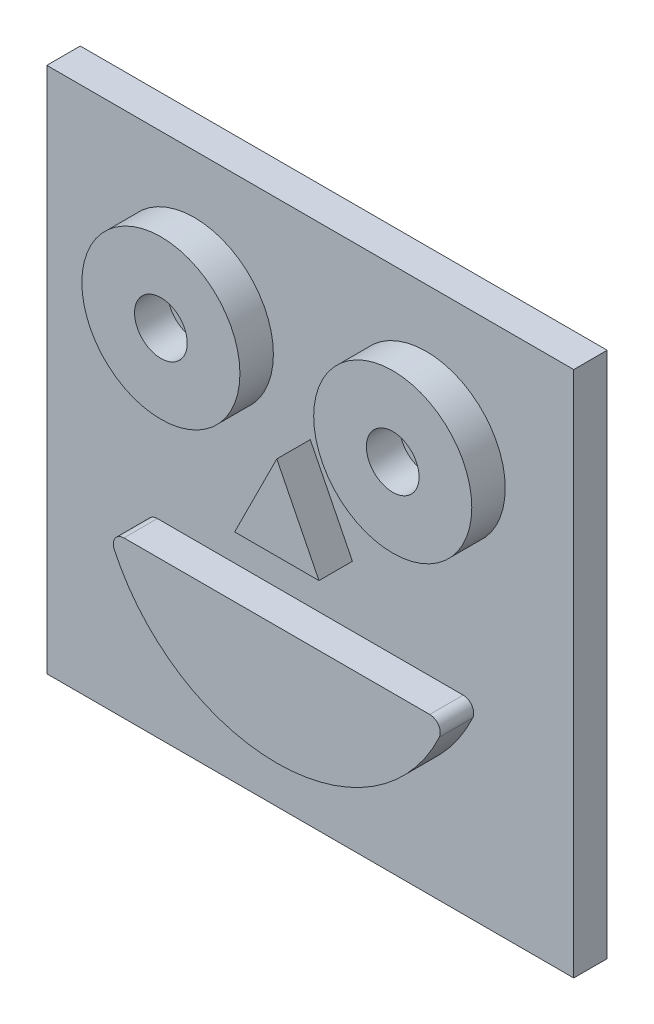
ISO-10303-21;
HEADER;
FILE_DESCRIPTION(('STEP AP214'),'2;1');
FILE_NAME('part.step','',(''),(''),'','','');
FILE_SCHEMA(('AUTOMOTIVE_DESIGN { 1 0 10303 214 1 1 1 1 }'));
ENDSEC;
DATA;
#1=APPLICATION_CONTEXT('core data for automotive mechanical design processes');
#2=APPLICATION_PROTOCOL_DEFINITION('international standard','automotive_design',2000,#1);
#3=PRODUCT_CONTEXT('',#1,'mechanical');
#4=PRODUCT('Part','Part','',(#3));
#5=PRODUCT_RELATED_PRODUCT_CATEGORY('part','',(#4));
#6=PRODUCT_DEFINITION_FORMATION('','',#4);
#7=PRODUCT_DEFINITION_CONTEXT('part definition',#1,'design');
#8=PRODUCT_DEFINITION('design','',#6,#7);
#9=PRODUCT_DEFINITION_SHAPE('','',#8);
#10=(LENGTH_UNIT() NAMED_UNIT(*) SI_UNIT(.MILLI.,.METRE.));
#11=(NAMED_UNIT(*) PLANE_ANGLE_UNIT() SI_UNIT($,.RADIAN.));
#12=(NAMED_UNIT(*) SI_UNIT($,.STERADIAN.) SOLID_ANGLE_UNIT());
#13=UNCERTAINTY_MEASURE_WITH_UNIT(LENGTH_MEASURE(1.E-05),#10,'distance_accuracy_value','');
#14=(GEOMETRIC_REPRESENTATION_CONTEXT(3) GLOBAL_UNCERTAINTY_ASSIGNED_CONTEXT((#13)) GLOBAL_UNIT_ASSIGNED_CONTEXT((#10,
#11,#12)) REPRESENTATION_CONTEXT('',''));
#15=CARTESIAN_POINT('',(0.,0.,0.));
#16=DIRECTION('',(0.,0.,1.));
#17=DIRECTION('',(1.,0.,0.));
#18=AXIS2_PLACEMENT_3D('',#15,#16,#17);
#19=CARTESIAN_POINT('',(0.,0.,3.175));
#20=DIRECTION('',(0.,0.,-1.));
#21=DIRECTION('',(-1.,0.,0.));
#22=AXIS2_PLACEMENT_3D('',#19,#20,#21);
#23=PLANE('',#22);
#24=CARTESIAN_POINT('',(0.,-1.25543735346197,3.175));
#25=DIRECTION('',(0.,0.,1.));
#26=DIRECTION('',(1.,0.,0.));
#27=AXIS2_PLACEMENT_3D('',#24,#25,#26);
#28=CIRCLE('',#27,17.);
#29=CARTESIAN_POINT('',(-15.415804946535,-8.42153516540863,3.175));
#30=VERTEX_POINT('',#29);
#31=CARTESIAN_POINT('',(15.415804946535,-8.42153516540863,3.175));
#32=VERTEX_POINT('',#31);
#33=EDGE_CURVE('E140',#30,#32,#28,.T.);
#34=ORIENTED_EDGE('',*,*,#33,.F.);
#35=CARTESIAN_POINT('',(-14.5089928908565,-8.,3.175));
#36=DIRECTION('',(0.,0.,-1.));
#37=DIRECTION('',(-1.,0.,0.));
#38=AXIS2_PLACEMENT_3D('',#35,#36,#37);
#39=CIRCLE('',#38,1.);
#40=CARTESIAN_POINT('',(-14.5089928908565,-7.,3.175));
#41=VERTEX_POINT('',#40);
#42=EDGE_CURVE('E11',#30,#41,#39,.T.);
#43=ORIENTED_EDGE('',*,*,#42,.T.);
#44=DIRECTION('',(-1.,0.,0.));
#45=VECTOR('',#44,1.);
#46=CARTESIAN_POINT('',(-16.,-7.,3.175));
#47=LINE('',#46,#45);
#48=CARTESIAN_POINT('',(14.5089928908565,-7.,3.175));
#49=VERTEX_POINT('',#48);
#50=EDGE_CURVE('E142',#49,#41,#47,.T.);
#51=ORIENTED_EDGE('',*,*,#50,.F.);
#52=CARTESIAN_POINT('',(14.5089928908565,-8.,3.175));
#53=DIRECTION('',(0.,0.,-1.));
#54=DIRECTION('',(-1.,0.,0.));
#55=AXIS2_PLACEMENT_3D('',#52,#53,#54);
#56=CIRCLE('',#55,1.);
#57=EDGE_CURVE('E41',#49,#32,#56,.T.);
#58=ORIENTED_EDGE('',*,*,#57,.T.);
#59=EDGE_LOOP('',(#34,#43,#51,#58));
#60=FACE_BOUND('',#59,.T.);
#61=CARTESIAN_POINT('',(11.,12.,3.175));
#62=DIRECTION('',(0.,0.,-1.));
#63=DIRECTION('',(-1.,0.,0.));
#64=AXIS2_PLACEMENT_3D('',#61,#62,#63);
#65=CIRCLE('',#64,7.5);
#66=CARTESIAN_POINT('',(3.5,12.,3.175));
#67=VERTEX_POINT('',#66);
#68=EDGE_CURVE('E205',#67,#67,#65,.F.);
#69=ORIENTED_EDGE('',*,*,#68,.F.);
#70=EDGE_LOOP('',(#69));
#71=FACE_BOUND('',#70,.T.);
#72=CARTESIAN_POINT('',(-11.,12.,3.175));
#73=DIRECTION('',(0.,0.,-1.));
#74=DIRECTION('',(-1.,0.,0.));
#75=AXIS2_PLACEMENT_3D('',#72,#73,#74);
#76=CIRCLE('',#75,7.5);
#77=CARTESIAN_POINT('',(-18.5,12.,3.175));
#78=VERTEX_POINT('',#77);
#79=EDGE_CURVE('E202',#78,#78,#76,.F.);
#80=ORIENTED_EDGE('',*,*,#79,.F.);
#81=EDGE_LOOP('',(#80));
#82=FACE_BOUND('',#81,.T.);
#83=DIRECTION('',(0.,1.,0.));
#84=VECTOR('',#83,1.);
#85=CARTESIAN_POINT('',(24.9999999999999,-25.0000000000001,3.175));
#86=LINE('',#85,#84);
#87=CARTESIAN_POINT('',(24.9999999999999,-25.0000000000001,3.175));
#88=VERTEX_POINT('',#87);
#89=CARTESIAN_POINT('',(24.9999999999999,25.,3.175));
#90=VERTEX_POINT('',#89);
#91=EDGE_CURVE('E173',#88,#90,#86,.T.);
#92=ORIENTED_EDGE('',*,*,#91,.T.);
#93=DIRECTION('',(-1.,0.,0.));
#94=VECTOR('',#93,1.);
#95=CARTESIAN_POINT('',(-25.0000000000001,25.,3.175));
#96=LINE('',#95,#94);
#97=CARTESIAN_POINT('',(-25.0000000000001,25.,3.175));
#98=VERTEX_POINT('',#97);
#99=EDGE_CURVE('E176',#90,#98,#96,.T.);
#100=ORIENTED_EDGE('',*,*,#99,.T.);
#101=DIRECTION('',(0.,-1.,0.));
#102=VECTOR('',#101,1.);
#103=CARTESIAN_POINT('',(-25.0000000000001,-25.0000000000001,3.175));
#104=LINE('',#103,#102);
#105=CARTESIAN_POINT('',(-25.0000000000001,-25.0000000000001,3.175));
#106=VERTEX_POINT('',#105);
#107=EDGE_CURVE('E179',#98,#106,#104,.T.);
#108=ORIENTED_EDGE('',*,*,#107,.T.);
#109=DIRECTION('',(1.,0.,0.));
#110=VECTOR('',#109,1.);
#111=CARTESIAN_POINT('',(-25.0000000000001,-25.0000000000001,3.175));
#112=LINE('',#111,#110);
#113=EDGE_CURVE('E181',#106,#88,#112,.T.);
#114=ORIENTED_EDGE('',*,*,#113,.T.);
#115=EDGE_LOOP('',(#92,#100,#108,#114));
#116=FACE_BOUND('',#115,.T.);
#117=DIRECTION('',(-0.447213595499958,-0.894427190999916,0.));
#118=VECTOR('',#117,1.);
#119=CARTESIAN_POINT('',(-4.,-1.25543735346197,3.175));
#120=LINE('',#119,#118);
#121=CARTESIAN_POINT('',(0.,6.74456264653803,3.175));
#122=VERTEX_POINT('',#121);
#123=CARTESIAN_POINT('',(-4.,-1.25543735346197,3.175));
#124=VERTEX_POINT('',#123);
#125=EDGE_CURVE('E139',#122,#124,#120,.T.);
#126=ORIENTED_EDGE('',*,*,#125,.F.);
#127=DIRECTION('',(-0.447213595499958,0.894427190999916,0.));
#128=VECTOR('',#127,1.);
#129=CARTESIAN_POINT('',(0.,6.74456264653803,3.175));
#130=LINE('',#129,#128);
#131=CARTESIAN_POINT('',(4.,-1.25543735346197,3.175));
#132=VERTEX_POINT('',#131);
#133=EDGE_CURVE('E136',#132,#122,#130,.T.);
#134=ORIENTED_EDGE('',*,*,#133,.F.);
#135=DIRECTION('',(1.,0.,0.));
#136=VECTOR('',#135,1.);
#137=CARTESIAN_POINT('',(4.,-1.25543735346197,3.175));
#138=LINE('',#137,#136);
#139=EDGE_CURVE('E297',#124,#132,#138,.T.);
#140=ORIENTED_EDGE('',*,*,#139,.F.);
#141=EDGE_LOOP('',(#126,#134,#140));
#142=FACE_BOUND('',#141,.T.);
#143=ADVANCED_FACE('F33',(#60,#71,#82,#116,#142),#23,.F.);
#144=CARTESIAN_POINT('',(24.9999999999999,-25.0000000000001,3.175));
#145=DIRECTION('',(-1.,0.,0.));
#146=DIRECTION('',(0.,0.,1.));
#147=AXIS2_PLACEMENT_3D('',#144,#145,#146);
#148=PLANE('',#147);
#149=DIRECTION('',(0.,1.,0.));
#150=VECTOR('',#149,1.);
#151=CARTESIAN_POINT('',(24.9999999999999,-25.0000000000001,0.));
#152=LINE('',#151,#150);
#153=CARTESIAN_POINT('',(24.9999999999999,-25.0000000000001,0.));
#154=VERTEX_POINT('',#153);
#155=CARTESIAN_POINT('',(24.9999999999999,25.,0.));
#156=VERTEX_POINT('',#155);
#157=EDGE_CURVE('E172',#154,#156,#152,.T.);
#158=ORIENTED_EDGE('',*,*,#157,.T.);
#159=DIRECTION('',(0.,0.,-1.));
#160=VECTOR('',#159,1.);
#161=CARTESIAN_POINT('',(24.9999999999999,25.,3.175));
#162=LINE('',#161,#160);
#163=EDGE_CURVE('E199',#90,#156,#162,.T.);
#164=ORIENTED_EDGE('',*,*,#163,.F.);
#165=ORIENTED_EDGE('',*,*,#91,.F.);
#166=DIRECTION('',(0.,0.,-1.));
#167=VECTOR('',#166,1.);
#168=CARTESIAN_POINT('',(24.9999999999999,-25.0000000000001,3.175));
#169=LINE('',#168,#167);
#170=EDGE_CURVE('E183',#88,#154,#169,.T.);
#171=ORIENTED_EDGE('',*,*,#170,.T.);
#172=EDGE_LOOP('',(#158,#164,#165,#171));
#173=FACE_BOUND('',#172,.T.);
#174=ADVANCED_FACE('F240',(#173),#148,.F.);
#175=CARTESIAN_POINT('',(-25.0000000000001,25.,3.175));
#176=DIRECTION('',(0.,-1.,0.));
#177=DIRECTION('',(0.,0.,-1.));
#178=AXIS2_PLACEMENT_3D('',#175,#176,#177);
#179=PLANE('',#178);
#180=DIRECTION('',(-1.,0.,0.));
#181=VECTOR('',#180,1.);
#182=CARTESIAN_POINT('',(-25.0000000000001,25.,0.));
#183=LINE('',#182,#181);
#184=CARTESIAN_POINT('',(-25.0000000000001,25.,0.));
#185=VERTEX_POINT('',#184);
#186=EDGE_CURVE('E186',#156,#185,#183,.T.);
#187=ORIENTED_EDGE('',*,*,#186,.T.);
#188=DIRECTION('',(0.,0.,-1.));
#189=VECTOR('',#188,1.);
#190=CARTESIAN_POINT('',(-25.0000000000001,25.,3.175));
#191=LINE('',#190,#189);
#192=EDGE_CURVE('E196',#98,#185,#191,.T.);
#193=ORIENTED_EDGE('',*,*,#192,.F.);
#194=ORIENTED_EDGE('',*,*,#99,.F.);
#195=ORIENTED_EDGE('',*,*,#163,.T.);
#196=EDGE_LOOP('',(#187,#193,#194,#195));
#197=FACE_BOUND('',#196,.T.);
#198=ADVANCED_FACE('F247',(#197),#179,.F.);
#199=CARTESIAN_POINT('',(-25.0000000000001,-25.0000000000001,3.175));
#200=DIRECTION('',(1.,0.,0.));
#201=DIRECTION('',(0.,0.,-1.));
#202=AXIS2_PLACEMENT_3D('',#199,#200,#201);
#203=PLANE('',#202);
#204=DIRECTION('',(0.,-1.,0.));
#205=VECTOR('',#204,1.);
#206=CARTESIAN_POINT('',(-25.0000000000001,-25.0000000000001,0.));
#207=LINE('',#206,#205);
#208=CARTESIAN_POINT('',(-25.0000000000001,-25.0000000000001,0.));
#209=VERTEX_POINT('',#208);
#210=EDGE_CURVE('E188',#185,#209,#207,.T.);
#211=ORIENTED_EDGE('',*,*,#210,.T.);
#212=DIRECTION('',(0.,0.,-1.));
#213=VECTOR('',#212,1.);
#214=CARTESIAN_POINT('',(-25.0000000000001,-25.0000000000001,3.175));
#215=LINE('',#214,#213);
#216=EDGE_CURVE('E193',#106,#209,#215,.T.);
#217=ORIENTED_EDGE('',*,*,#216,.F.);
#218=ORIENTED_EDGE('',*,*,#107,.F.);
#219=ORIENTED_EDGE('',*,*,#192,.T.);
#220=EDGE_LOOP('',(#211,#217,#218,#219));
#221=FACE_BOUND('',#220,.T.);
#222=ADVANCED_FACE('F375',(#221),#203,.F.);
#223=CARTESIAN_POINT('',(-25.0000000000001,-25.0000000000001,3.175));
#224=DIRECTION('',(0.,1.,0.));
#225=DIRECTION('',(0.,0.,1.));
#226=AXIS2_PLACEMENT_3D('',#223,#224,#225);
#227=PLANE('',#226);
#228=DIRECTION('',(1.,0.,0.));
#229=VECTOR('',#228,1.);
#230=CARTESIAN_POINT('',(-25.0000000000001,-25.0000000000001,0.));
#231=LINE('',#230,#229);
#232=EDGE_CURVE('E177',#209,#154,#231,.T.);
#233=ORIENTED_EDGE('',*,*,#232,.T.);
#234=ORIENTED_EDGE('',*,*,#170,.F.);
#235=ORIENTED_EDGE('',*,*,#113,.F.);
#236=ORIENTED_EDGE('',*,*,#216,.T.);
#237=EDGE_LOOP('',(#233,#234,#235,#236));
#238=FACE_BOUND('',#237,.T.);
#239=ADVANCED_FACE('F284',(#238),#227,.F.);
#240=CARTESIAN_POINT('',(0.,0.,0.));
#241=DIRECTION('',(0.,0.,-1.));
#242=DIRECTION('',(-1.,0.,0.));
#243=AXIS2_PLACEMENT_3D('',#240,#241,#242);
#244=PLANE('',#243);
#245=ORIENTED_EDGE('',*,*,#157,.F.);
#246=ORIENTED_EDGE('',*,*,#232,.F.);
#247=ORIENTED_EDGE('',*,*,#210,.F.);
#248=ORIENTED_EDGE('',*,*,#186,.F.);
#249=EDGE_LOOP('',(#245,#246,#247,#248));
#250=FACE_BOUND('',#249,.T.);
#251=ADVANCED_FACE('F279',(#250),#244,.T.);
#252=CARTESIAN_POINT('',(-11.,12.,6.35));
#253=DIRECTION('',(0.,0.,1.));
#254=DIRECTION('',(1.,0.,0.));
#255=AXIS2_PLACEMENT_3D('',#252,#253,#254);
#256=PLANE('',#255);
#257=CARTESIAN_POINT('',(-11.,12.,6.35));
#258=DIRECTION('',(0.,0.,1.));
#259=DIRECTION('',(1.,0.,0.));
#260=AXIS2_PLACEMENT_3D('',#257,#258,#259);
#261=CIRCLE('',#260,7.5);
#262=CARTESIAN_POINT('',(-3.5,12.,6.35));
#263=VERTEX_POINT('',#262);
#264=EDGE_CURVE('E167',#263,#263,#261,.T.);
#265=ORIENTED_EDGE('',*,*,#264,.T.);
#266=EDGE_LOOP('',(#265));
#267=FACE_BOUND('',#266,.T.);
#268=CARTESIAN_POINT('',(-11.,12.,6.35));
#269=DIRECTION('',(0.,0.,1.));
#270=DIRECTION('',(1.,0.,0.));
#271=AXIS2_PLACEMENT_3D('',#268,#269,#270);
#272=CIRCLE('',#271,2.5);
#273=CARTESIAN_POINT('',(-8.5,12.,6.35));
#274=VERTEX_POINT('',#273);
#275=EDGE_CURVE('E164',#274,#274,#272,.T.);
#276=ORIENTED_EDGE('',*,*,#275,.F.);
#277=EDGE_LOOP('',(#276));
#278=FACE_BOUND('',#277,.T.);
#279=ADVANCED_FACE('F274',(#267,#278),#256,.T.);
#280=CARTESIAN_POINT('',(-11.,12.,6.35));
#281=DIRECTION('',(0.,0.,-1.));
#282=DIRECTION('',(-1.,0.,0.));
#283=AXIS2_PLACEMENT_3D('',#280,#281,#282);
#284=CYLINDRICAL_SURFACE('',#283,7.5);
#285=ORIENTED_EDGE('',*,*,#264,.F.);
#286=EDGE_LOOP('',(#285));
#287=FACE_BOUND('',#286,.T.);
#288=ORIENTED_EDGE('',*,*,#79,.T.);
#289=EDGE_LOOP('',(#288));
#290=FACE_BOUND('',#289,.T.);
#291=ADVANCED_FACE('F266',(#287,#290),#284,.T.);
#292=CARTESIAN_POINT('',(-11.,12.,6.35));
#293=DIRECTION('',(0.,0.,-1.));
#294=DIRECTION('',(-1.,0.,0.));
#295=AXIS2_PLACEMENT_3D('',#292,#293,#294);
#296=CYLINDRICAL_SURFACE('',#295,2.5);
#297=ORIENTED_EDGE('',*,*,#275,.T.);
#298=EDGE_LOOP('',(#297));
#299=FACE_BOUND('',#298,.T.);
#300=CARTESIAN_POINT('',(-11.,12.,3.175));
#301=DIRECTION('',(0.,0.,1.));
#302=DIRECTION('',(1.,0.,0.));
#303=AXIS2_PLACEMENT_3D('',#300,#301,#302);
#304=CIRCLE('',#303,2.5);
#305=CARTESIAN_POINT('',(-8.5,12.,3.175));
#306=VERTEX_POINT('',#305);
#307=EDGE_CURVE('E163',#306,#306,#304,.T.);
#308=ORIENTED_EDGE('',*,*,#307,.F.);
#309=EDGE_LOOP('',(#308));
#310=FACE_BOUND('',#309,.T.);
#311=ADVANCED_FACE('F257',(#299,#310),#296,.F.);
#312=ORIENTED_EDGE('',*,*,#307,.T.);
#313=EDGE_LOOP('',(#312));
#314=FACE_BOUND('',#313,.T.);
#315=ADVANCED_FACE('F243',(#314),#23,.F.);
#316=CARTESIAN_POINT('',(11.,12.,6.35));
#317=DIRECTION('',(0.,0.,1.));
#318=DIRECTION('',(1.,0.,0.));
#319=AXIS2_PLACEMENT_3D('',#316,#317,#318);
#320=PLANE('',#319);
#321=CARTESIAN_POINT('',(11.,12.,6.35));
#322=DIRECTION('',(0.,0.,1.));
#323=DIRECTION('',(1.,0.,0.));
#324=AXIS2_PLACEMENT_3D('',#321,#322,#323);
#325=CIRCLE('',#324,7.5);
#326=CARTESIAN_POINT('',(18.5,12.,6.35));
#327=VERTEX_POINT('',#326);
#328=EDGE_CURVE('E158',#327,#327,#325,.T.);
#329=ORIENTED_EDGE('',*,*,#328,.T.);
#330=EDGE_LOOP('',(#329));
#331=FACE_BOUND('',#330,.T.);
#332=CARTESIAN_POINT('',(11.,12.,6.35));
#333=DIRECTION('',(0.,0.,1.));
#334=DIRECTION('',(1.,0.,0.));
#335=AXIS2_PLACEMENT_3D('',#332,#333,#334);
#336=CIRCLE('',#335,2.5);
#337=CARTESIAN_POINT('',(13.5,12.,6.35));
#338=VERTEX_POINT('',#337);
#339=EDGE_CURVE('E155',#338,#338,#336,.T.);
#340=ORIENTED_EDGE('',*,*,#339,.F.);
#341=EDGE_LOOP('',(#340));
#342=FACE_BOUND('',#341,.T.);
#343=ADVANCED_FACE('F256',(#331,#342),#320,.T.);
#344=CARTESIAN_POINT('',(11.,12.,6.35));
#345=DIRECTION('',(0.,0.,-1.));
#346=DIRECTION('',(-1.,0.,0.));
#347=AXIS2_PLACEMENT_3D('',#344,#345,#346);
#348=CYLINDRICAL_SURFACE('',#347,7.5);
#349=ORIENTED_EDGE('',*,*,#328,.F.);
#350=EDGE_LOOP('',(#349));
#351=FACE_BOUND('',#350,.T.);
#352=ORIENTED_EDGE('',*,*,#68,.T.);
#353=EDGE_LOOP('',(#352));
#354=FACE_BOUND('',#353,.T.);
#355=ADVANCED_FACE('F263',(#351,#354),#348,.T.);
#356=CARTESIAN_POINT('',(11.,12.,6.35));
#357=DIRECTION('',(0.,0.,-1.));
#358=DIRECTION('',(-1.,0.,0.));
#359=AXIS2_PLACEMENT_3D('',#356,#357,#358);
#360=CYLINDRICAL_SURFACE('',#359,2.5);
#361=ORIENTED_EDGE('',*,*,#339,.T.);
#362=EDGE_LOOP('',(#361));
#363=FACE_BOUND('',#362,.T.);
#364=CARTESIAN_POINT('',(11.,12.,3.175));
#365=DIRECTION('',(0.,0.,1.));
#366=DIRECTION('',(1.,0.,0.));
#367=AXIS2_PLACEMENT_3D('',#364,#365,#366);
#368=CIRCLE('',#367,2.5);
#369=CARTESIAN_POINT('',(13.5,12.,3.175));
#370=VERTEX_POINT('',#369);
#371=EDGE_CURVE('E151',#370,#370,#368,.T.);
#372=ORIENTED_EDGE('',*,*,#371,.F.);
#373=EDGE_LOOP('',(#372));
#374=FACE_BOUND('',#373,.T.);
#375=ADVANCED_FACE('F253',(#363,#374),#360,.F.);
#376=ORIENTED_EDGE('',*,*,#371,.T.);
#377=EDGE_LOOP('',(#376));
#378=FACE_BOUND('',#377,.T.);
#379=ADVANCED_FACE('F242',(#378),#23,.F.);
#380=CARTESIAN_POINT('',(0.,-1.25543735346197,6.35));
#381=DIRECTION('',(0.,0.,-1.));
#382=DIRECTION('',(-1.,0.,0.));
#383=AXIS2_PLACEMENT_3D('',#380,#381,#382);
#384=CYLINDRICAL_SURFACE('',#383,17.);
#385=ORIENTED_EDGE('',*,*,#33,.T.);
#386=DIRECTION('',(0.,0.,-1.));
#387=VECTOR('',#386,1.);
#388=CARTESIAN_POINT('',(15.415804946535,-8.42153516540863,6.35));
#389=LINE('',#388,#387);
#390=CARTESIAN_POINT('',(15.415804946535,-8.42153516540863,6.35));
#391=VERTEX_POINT('',#390);
#392=EDGE_CURVE('E48',#32,#391,#389,.F.);
#393=ORIENTED_EDGE('',*,*,#392,.T.);
#394=CARTESIAN_POINT('',(0.,-1.25543735346197,6.35));
#395=DIRECTION('',(0.,0.,1.));
#396=DIRECTION('',(1.,0.,0.));
#397=AXIS2_PLACEMENT_3D('',#394,#395,#396);
#398=CIRCLE('',#397,17.);
#399=CARTESIAN_POINT('',(-15.415804946535,-8.42153516540863,6.35));
#400=VERTEX_POINT('',#399);
#401=EDGE_CURVE('E148',#400,#391,#398,.T.);
#402=ORIENTED_EDGE('',*,*,#401,.F.);
#403=DIRECTION('',(0.,0.,-1.));
#404=VECTOR('',#403,1.);
#405=CARTESIAN_POINT('',(-15.415804946535,-8.42153516540863,6.35));
#406=LINE('',#405,#404);
#407=EDGE_CURVE('E213',#400,#30,#406,.T.);
#408=ORIENTED_EDGE('',*,*,#407,.T.);
#409=EDGE_LOOP('',(#385,#393,#402,#408));
#410=FACE_BOUND('',#409,.T.);
#411=ADVANCED_FACE('F225',(#410),#384,.T.);
#412=CARTESIAN_POINT('',(-16.,-7.,6.35));
#413=DIRECTION('',(0.,-1.,0.));
#414=DIRECTION('',(0.,0.,-1.));
#415=AXIS2_PLACEMENT_3D('',#412,#413,#414);
#416=PLANE('',#415);
#417=DIRECTION('',(-1.,0.,0.));
#418=VECTOR('',#417,1.);
#419=CARTESIAN_POINT('',(-16.,-7.,6.35));
#420=LINE('',#419,#418);
#421=CARTESIAN_POINT('',(14.5089928908565,-7.,6.35));
#422=VERTEX_POINT('',#421);
#423=CARTESIAN_POINT('',(-14.5089928908565,-7.,6.35));
#424=VERTEX_POINT('',#423);
#425=EDGE_CURVE('E150',#422,#424,#420,.T.);
#426=ORIENTED_EDGE('',*,*,#425,.F.);
#427=DIRECTION('',(0.,0.,-1.));
#428=VECTOR('',#427,1.);
#429=CARTESIAN_POINT('',(14.5089928908565,-7.,6.35));
#430=LINE('',#429,#428);
#431=EDGE_CURVE('E210',#422,#49,#430,.T.);
#432=ORIENTED_EDGE('',*,*,#431,.T.);
#433=ORIENTED_EDGE('',*,*,#50,.T.);
#434=DIRECTION('',(0.,0.,-1.));
#435=VECTOR('',#434,1.);
#436=CARTESIAN_POINT('',(-14.5089928908565,-7.,6.35));
#437=LINE('',#436,#435);
#438=EDGE_CURVE('E208',#41,#424,#437,.F.);
#439=ORIENTED_EDGE('',*,*,#438,.T.);
#440=EDGE_LOOP('',(#426,#432,#433,#439));
#441=FACE_BOUND('',#440,.T.);
#442=ADVANCED_FACE('F232',(#441),#416,.F.);
#443=CARTESIAN_POINT('',(0.,-1.25543735346197,6.35));
#444=DIRECTION('',(0.,0.,1.));
#445=DIRECTION('',(1.,0.,0.));
#446=AXIS2_PLACEMENT_3D('',#443,#444,#445);
#447=PLANE('',#446);
#448=ORIENTED_EDGE('',*,*,#401,.T.);
#449=CARTESIAN_POINT('',(14.5089928908565,-8.,6.35));
#450=DIRECTION('',(0.,0.,1.));
#451=DIRECTION('',(1.,0.,0.));
#452=AXIS2_PLACEMENT_3D('',#449,#450,#451);
#453=CIRCLE('',#452,1.);
#454=EDGE_CURVE('E218',#391,#422,#453,.T.);
#455=ORIENTED_EDGE('',*,*,#454,.T.);
#456=ORIENTED_EDGE('',*,*,#425,.T.);
#457=CARTESIAN_POINT('',(-14.5089928908565,-8.,6.35));
#458=DIRECTION('',(0.,0.,1.));
#459=DIRECTION('',(1.,0.,0.));
#460=AXIS2_PLACEMENT_3D('',#457,#458,#459);
#461=CIRCLE('',#460,1.);
#462=EDGE_CURVE('E55',#424,#400,#461,.T.);
#463=ORIENTED_EDGE('',*,*,#462,.T.);
#464=EDGE_LOOP('',(#448,#455,#456,#463));
#465=FACE_BOUND('',#464,.T.);
#466=ADVANCED_FACE('F230',(#465),#447,.T.);
#467=CARTESIAN_POINT('',(-4.,-1.25543735346197,6.35));
#468=DIRECTION('',(0.894427190999916,-0.447213595499958,0.));
#469=DIRECTION('',(0.447213595499958,0.894427190999916,0.));
#470=AXIS2_PLACEMENT_3D('',#467,#468,#469);
#471=PLANE('',#470);
#472=ORIENTED_EDGE('',*,*,#125,.T.);
#473=DIRECTION('',(0.,0.,-1.));
#474=VECTOR('',#473,1.);
#475=CARTESIAN_POINT('',(-4.,-1.25543735346197,6.35));
#476=LINE('',#475,#474);
#477=CARTESIAN_POINT('',(-4.,-1.25543735346197,6.35));
#478=VERTEX_POINT('',#477);
#479=EDGE_CURVE('E122',#478,#124,#476,.T.);
#480=ORIENTED_EDGE('',*,*,#479,.F.);
#481=DIRECTION('',(-0.447213595499958,-0.894427190999916,0.));
#482=VECTOR('',#481,1.);
#483=CARTESIAN_POINT('',(-4.,-1.25543735346197,6.35));
#484=LINE('',#483,#482);
#485=CARTESIAN_POINT('',(0.,6.74456264653803,6.35));
#486=VERTEX_POINT('',#485);
#487=EDGE_CURVE('E129',#486,#478,#484,.T.);
#488=ORIENTED_EDGE('',*,*,#487,.F.);
#489=DIRECTION('',(0.,0.,-1.));
#490=VECTOR('',#489,1.);
#491=CARTESIAN_POINT('',(0.,6.74456264653803,6.35));
#492=LINE('',#491,#490);
#493=EDGE_CURVE('E144',#486,#122,#492,.T.);
#494=ORIENTED_EDGE('',*,*,#493,.T.);
#495=EDGE_LOOP('',(#472,#480,#488,#494));
#496=FACE_BOUND('',#495,.T.);
#497=ADVANCED_FACE('F138',(#496),#471,.F.);
#498=CARTESIAN_POINT('',(4.,-1.25543735346197,6.35));
#499=DIRECTION('',(0.,1.,0.));
#500=DIRECTION('',(-1.,0.,0.));
#501=AXIS2_PLACEMENT_3D('',#498,#499,#500);
#502=PLANE('',#501);
#503=ORIENTED_EDGE('',*,*,#139,.T.);
#504=DIRECTION('',(0.,0.,-1.));
#505=VECTOR('',#504,1.);
#506=CARTESIAN_POINT('',(4.,-1.25543735346197,6.35));
#507=LINE('',#506,#505);
#508=CARTESIAN_POINT('',(4.,-1.25543735346197,6.35));
#509=VERTEX_POINT('',#508);
#510=EDGE_CURVE('E125',#509,#132,#507,.T.);
#511=ORIENTED_EDGE('',*,*,#510,.F.);
#512=DIRECTION('',(1.,0.,0.));
#513=VECTOR('',#512,1.);
#514=CARTESIAN_POINT('',(4.,-1.25543735346197,6.35));
#515=LINE('',#514,#513);
#516=EDGE_CURVE('E117',#478,#509,#515,.T.);
#517=ORIENTED_EDGE('',*,*,#516,.F.);
#518=ORIENTED_EDGE('',*,*,#479,.T.);
#519=EDGE_LOOP('',(#503,#511,#517,#518));
#520=FACE_BOUND('',#519,.T.);
#521=ADVANCED_FACE('F120',(#520),#502,.F.);
#522=CARTESIAN_POINT('',(0.,6.74456264653803,6.35));
#523=DIRECTION('',(-0.894427190999916,-0.447213595499958,0.));
#524=DIRECTION('',(0.447213595499958,-0.894427190999916,0.));
#525=AXIS2_PLACEMENT_3D('',#522,#523,#524);
#526=PLANE('',#525);
#527=ORIENTED_EDGE('',*,*,#133,.T.);
#528=ORIENTED_EDGE('',*,*,#493,.F.);
#529=DIRECTION('',(-0.447213595499958,0.894427190999916,0.));
#530=VECTOR('',#529,1.);
#531=CARTESIAN_POINT('',(0.,6.74456264653803,6.35));
#532=LINE('',#531,#530);
#533=EDGE_CURVE('E128',#509,#486,#532,.T.);
#534=ORIENTED_EDGE('',*,*,#533,.F.);
#535=ORIENTED_EDGE('',*,*,#510,.T.);
#536=EDGE_LOOP('',(#527,#528,#534,#535));
#537=FACE_BOUND('',#536,.T.);
#538=ADVANCED_FACE('F300',(#537),#526,.F.);
#539=CARTESIAN_POINT('',(0.,0.,6.35));
#540=DIRECTION('',(0.,0.,1.));
#541=DIRECTION('',(1.,0.,0.));
#542=AXIS2_PLACEMENT_3D('',#539,#540,#541);
#543=PLANE('',#542);
#544=ORIENTED_EDGE('',*,*,#487,.T.);
#545=ORIENTED_EDGE('',*,*,#516,.T.);
#546=ORIENTED_EDGE('',*,*,#533,.T.);
#547=EDGE_LOOP('',(#544,#545,#546));
#548=FACE_BOUND('',#547,.T.);
#549=ADVANCED_FACE('F132',(#548),#543,.T.);
#550=CARTESIAN_POINT('',(14.5089928908565,-8.,6.35));
#551=DIRECTION('',(0.,0.,-1.));
#552=DIRECTION('',(-1.,0.,0.));
#553=AXIS2_PLACEMENT_3D('',#550,#551,#552);
#554=CYLINDRICAL_SURFACE('',#553,1.);
#555=ORIENTED_EDGE('',*,*,#454,.F.);
#556=ORIENTED_EDGE('',*,*,#392,.F.);
#557=ORIENTED_EDGE('',*,*,#57,.F.);
#558=ORIENTED_EDGE('',*,*,#431,.F.);
#559=EDGE_LOOP('',(#555,#556,#557,#558));
#560=FACE_BOUND('',#559,.T.);
#561=ADVANCED_FACE('F228',(#560),#554,.T.);
#562=CARTESIAN_POINT('',(-14.5089928908565,-8.,6.35));
#563=DIRECTION('',(0.,0.,-1.));
#564=DIRECTION('',(-1.,0.,0.));
#565=AXIS2_PLACEMENT_3D('',#562,#563,#564);
#566=CYLINDRICAL_SURFACE('',#565,1.);
#567=ORIENTED_EDGE('',*,*,#462,.F.);
#568=ORIENTED_EDGE('',*,*,#438,.F.);
#569=ORIENTED_EDGE('',*,*,#42,.F.);
#570=ORIENTED_EDGE('',*,*,#407,.F.);
#571=EDGE_LOOP('',(#567,#568,#569,#570));
#572=FACE_BOUND('',#571,.T.);
#573=ADVANCED_FACE('F35',(#572),#566,.T.);
#574=CLOSED_SHELL('',(#143,#174,#198,#222,#239,#251,#279,#291,#311,#315,#343,#355,#375,#379,
#411,#442,#466,#497,#521,#538,#549,#561,#573));
#575=MANIFOLD_SOLID_BREP('B2',#574);
#576=ADVANCED_BREP_SHAPE_REPRESENTATION('',(#18,#575),#14);
#577=SHAPE_DEFINITION_REPRESENTATION(#9,#576);
ENDSEC;
END-ISO-10303-21;
